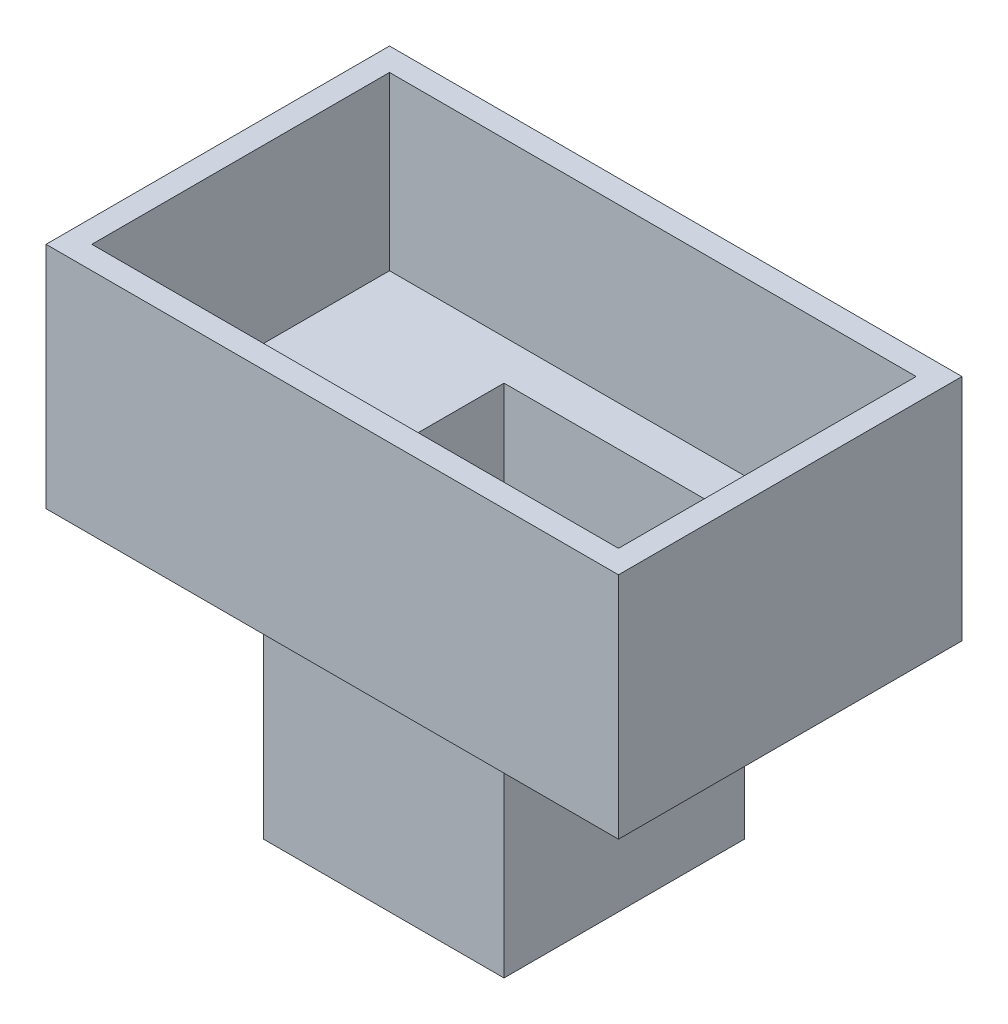
ISO-10303-21;
HEADER;
FILE_DESCRIPTION(('STEP AP214'),'2;1');
FILE_NAME('part.step','',(''),(''),'','','');
FILE_SCHEMA(('AUTOMOTIVE_DESIGN { 1 0 10303 214 1 1 1 1 }'));
ENDSEC;
DATA;
#1=APPLICATION_CONTEXT('core data for automotive mechanical design processes');
#2=APPLICATION_PROTOCOL_DEFINITION('international standard','automotive_design',2000,#1);
#3=PRODUCT_CONTEXT('',#1,'mechanical');
#4=PRODUCT('Part','Part','',(#3));
#5=PRODUCT_RELATED_PRODUCT_CATEGORY('part','',(#4));
#6=PRODUCT_DEFINITION_FORMATION('','',#4);
#7=PRODUCT_DEFINITION_CONTEXT('part definition',#1,'design');
#8=PRODUCT_DEFINITION('design','',#6,#7);
#9=PRODUCT_DEFINITION_SHAPE('','',#8);
#10=(LENGTH_UNIT() NAMED_UNIT(*) SI_UNIT(.MILLI.,.METRE.));
#11=(NAMED_UNIT(*) PLANE_ANGLE_UNIT() SI_UNIT($,.RADIAN.));
#12=(NAMED_UNIT(*) SI_UNIT($,.STERADIAN.) SOLID_ANGLE_UNIT());
#13=UNCERTAINTY_MEASURE_WITH_UNIT(LENGTH_MEASURE(1.E-05),#10,'distance_accuracy_value','');
#14=(GEOMETRIC_REPRESENTATION_CONTEXT(3) GLOBAL_UNCERTAINTY_ASSIGNED_CONTEXT((#13)) GLOBAL_UNIT_ASSIGNED_CONTEXT((#10,
#11,#12)) REPRESENTATION_CONTEXT('',''));
#15=CARTESIAN_POINT('',(0.,0.,0.));
#16=DIRECTION('',(0.,0.,1.));
#17=DIRECTION('',(1.,0.,0.));
#18=AXIS2_PLACEMENT_3D('',#15,#16,#17);
#19=CARTESIAN_POINT('',(-9.70588235294119,20.,-7.6764705882353));
#20=DIRECTION('',(1.,0.,0.));
#21=DIRECTION('',(0.,0.,-1.));
#22=AXIS2_PLACEMENT_3D('',#19,#20,#21);
#23=PLANE('',#22);
#24=DIRECTION('',(0.,0.,1.));
#25=VECTOR('',#24,1.);
#26=CARTESIAN_POINT('',(-9.70588235294119,0.,-7.6764705882353));
#27=LINE('',#26,#25);
#28=CARTESIAN_POINT('',(-9.70588235294119,0.,-7.6764705882353));
#29=VERTEX_POINT('',#28);
#30=CARTESIAN_POINT('',(-9.70588235294119,0.,13.3235294117647));
#31=VERTEX_POINT('',#30);
#32=EDGE_CURVE('E160',#29,#31,#27,.T.);
#33=ORIENTED_EDGE('',*,*,#32,.T.);
#34=DIRECTION('',(0.,-1.,0.));
#35=VECTOR('',#34,1.);
#36=CARTESIAN_POINT('',(-9.70588235294119,20.,13.3235294117647));
#37=LINE('',#36,#35);
#38=CARTESIAN_POINT('',(-9.70588235294119,20.,13.3235294117647));
#39=VERTEX_POINT('',#38);
#40=EDGE_CURVE('E168',#39,#31,#37,.T.);
#41=ORIENTED_EDGE('',*,*,#40,.F.);
#42=DIRECTION('',(0.,0.,1.));
#43=VECTOR('',#42,1.);
#44=CARTESIAN_POINT('',(-9.70588235294119,20.,-7.6764705882353));
#45=LINE('',#44,#43);
#46=CARTESIAN_POINT('',(-9.70588235294119,20.,-7.6764705882353));
#47=VERTEX_POINT('',#46);
#48=EDGE_CURVE('E191',#47,#39,#45,.T.);
#49=ORIENTED_EDGE('',*,*,#48,.F.);
#50=DIRECTION('',(0.,-1.,0.));
#51=VECTOR('',#50,1.);
#52=CARTESIAN_POINT('',(-9.70588235294119,20.,-7.6764705882353));
#53=LINE('',#52,#51);
#54=EDGE_CURVE('E185',#47,#29,#53,.T.);
#55=ORIENTED_EDGE('',*,*,#54,.T.);
#56=EDGE_LOOP('',(#33,#41,#49,#55));
#57=FACE_BOUND('',#56,.T.);
#58=ADVANCED_FACE('F41',(#57),#23,.F.);
#59=CARTESIAN_POINT('',(-9.70588235294119,20.,13.3235294117647));
#60=DIRECTION('',(0.,0.,-1.));
#61=DIRECTION('',(-1.,0.,0.));
#62=AXIS2_PLACEMENT_3D('',#59,#60,#61);
#63=PLANE('',#62);
#64=DIRECTION('',(1.,0.,0.));
#65=VECTOR('',#64,1.);
#66=CARTESIAN_POINT('',(-9.70588235294119,0.,13.3235294117647));
#67=LINE('',#66,#65);
#68=CARTESIAN_POINT('',(11.2941176470588,0.,13.3235294117647));
#69=VERTEX_POINT('',#68);
#70=EDGE_CURVE('E194',#31,#69,#67,.T.);
#71=ORIENTED_EDGE('',*,*,#70,.T.);
#72=DIRECTION('',(0.,-1.,0.));
#73=VECTOR('',#72,1.);
#74=CARTESIAN_POINT('',(11.2941176470588,20.,13.3235294117647));
#75=LINE('',#74,#73);
#76=CARTESIAN_POINT('',(11.2941176470588,20.,13.3235294117647));
#77=VERTEX_POINT('',#76);
#78=EDGE_CURVE('E179',#77,#69,#75,.T.);
#79=ORIENTED_EDGE('',*,*,#78,.F.);
#80=DIRECTION('',(1.,0.,0.));
#81=VECTOR('',#80,1.);
#82=CARTESIAN_POINT('',(-9.70588235294119,20.,13.3235294117647));
#83=LINE('',#82,#81);
#84=EDGE_CURVE('E203',#39,#77,#83,.T.);
#85=ORIENTED_EDGE('',*,*,#84,.F.);
#86=ORIENTED_EDGE('',*,*,#40,.T.);
#87=EDGE_LOOP('',(#71,#79,#85,#86));
#88=FACE_BOUND('',#87,.T.);
#89=ADVANCED_FACE('F337',(#88),#63,.F.);
#90=CARTESIAN_POINT('',(11.2941176470588,20.,-7.6764705882353));
#91=DIRECTION('',(-1.,0.,0.));
#92=DIRECTION('',(0.,0.,1.));
#93=AXIS2_PLACEMENT_3D('',#90,#91,#92);
#94=PLANE('',#93);
#95=DIRECTION('',(0.,0.,-1.));
#96=VECTOR('',#95,1.);
#97=CARTESIAN_POINT('',(11.2941176470588,0.,-7.6764705882353));
#98=LINE('',#97,#96);
#99=CARTESIAN_POINT('',(11.2941176470588,0.,-7.6764705882353));
#100=VERTEX_POINT('',#99);
#101=EDGE_CURVE('E192',#69,#100,#98,.T.);
#102=ORIENTED_EDGE('',*,*,#101,.T.);
#103=DIRECTION('',(0.,-1.,0.));
#104=VECTOR('',#103,1.);
#105=CARTESIAN_POINT('',(11.2941176470588,20.,-7.6764705882353));
#106=LINE('',#105,#104);
#107=CARTESIAN_POINT('',(11.2941176470588,20.,-7.6764705882353));
#108=VERTEX_POINT('',#107);
#109=EDGE_CURVE('E182',#108,#100,#106,.T.);
#110=ORIENTED_EDGE('',*,*,#109,.F.);
#111=DIRECTION('',(0.,0.,-1.));
#112=VECTOR('',#111,1.);
#113=CARTESIAN_POINT('',(11.2941176470588,20.,-7.6764705882353));
#114=LINE('',#113,#112);
#115=EDGE_CURVE('E200',#77,#108,#114,.T.);
#116=ORIENTED_EDGE('',*,*,#115,.F.);
#117=ORIENTED_EDGE('',*,*,#78,.T.);
#118=EDGE_LOOP('',(#102,#110,#116,#117));
#119=FACE_BOUND('',#118,.T.);
#120=ADVANCED_FACE('F339',(#119),#94,.F.);
#121=CARTESIAN_POINT('',(-9.70588235294119,20.,-7.6764705882353));
#122=DIRECTION('',(0.,0.,1.));
#123=DIRECTION('',(1.,0.,0.));
#124=AXIS2_PLACEMENT_3D('',#121,#122,#123);
#125=PLANE('',#124);
#126=DIRECTION('',(-1.,0.,0.));
#127=VECTOR('',#126,1.);
#128=CARTESIAN_POINT('',(-9.70588235294119,0.,-7.6764705882353));
#129=LINE('',#128,#127);
#130=EDGE_CURVE('E189',#100,#29,#129,.T.);
#131=ORIENTED_EDGE('',*,*,#130,.T.);
#132=ORIENTED_EDGE('',*,*,#54,.F.);
#133=DIRECTION('',(-1.,0.,0.));
#134=VECTOR('',#133,1.);
#135=CARTESIAN_POINT('',(-9.70588235294119,20.,-7.6764705882353));
#136=LINE('',#135,#134);
#137=EDGE_CURVE('E188',#108,#47,#136,.T.);
#138=ORIENTED_EDGE('',*,*,#137,.F.);
#139=ORIENTED_EDGE('',*,*,#109,.T.);
#140=EDGE_LOOP('',(#131,#132,#138,#139));
#141=FACE_BOUND('',#140,.T.);
#142=ADVANCED_FACE('F328',(#141),#125,.F.);
#143=CARTESIAN_POINT('',(0.,0.,0.));
#144=DIRECTION('',(0.,1.,0.));
#145=DIRECTION('',(0.,0.,1.));
#146=AXIS2_PLACEMENT_3D('',#143,#144,#145);
#147=PLANE('',#146);
#148=DIRECTION('',(-1.,0.,0.));
#149=VECTOR('',#148,1.);
#150=CARTESIAN_POINT('',(-8.70588235294119,0.,-6.6764705882353));
#151=LINE('',#150,#149);
#152=CARTESIAN_POINT('',(10.2941176470588,0.,-6.6764705882353));
#153=VERTEX_POINT('',#152);
#154=CARTESIAN_POINT('',(-8.70588235294119,0.,-6.6764705882353));
#155=VERTEX_POINT('',#154);
#156=EDGE_CURVE('E211',#153,#155,#151,.T.);
#157=ORIENTED_EDGE('',*,*,#156,.T.);
#158=DIRECTION('',(0.,0.,1.));
#159=VECTOR('',#158,1.);
#160=CARTESIAN_POINT('',(-8.70588235294119,0.,-6.6764705882353));
#161=LINE('',#160,#159);
#162=CARTESIAN_POINT('',(-8.70588235294119,0.,12.3235294117647));
#163=VERTEX_POINT('',#162);
#164=EDGE_CURVE('E158',#155,#163,#161,.T.);
#165=ORIENTED_EDGE('',*,*,#164,.T.);
#166=DIRECTION('',(1.,0.,0.));
#167=VECTOR('',#166,1.);
#168=CARTESIAN_POINT('',(-8.70588235294119,0.,12.3235294117647));
#169=LINE('',#168,#167);
#170=CARTESIAN_POINT('',(10.2941176470588,0.,12.3235294117647));
#171=VERTEX_POINT('',#170);
#172=EDGE_CURVE('E218',#163,#171,#169,.T.);
#173=ORIENTED_EDGE('',*,*,#172,.T.);
#174=DIRECTION('',(0.,0.,-1.));
#175=VECTOR('',#174,1.);
#176=CARTESIAN_POINT('',(10.2941176470588,0.,-6.6764705882353));
#177=LINE('',#176,#175);
#178=EDGE_CURVE('E215',#171,#153,#177,.T.);
#179=ORIENTED_EDGE('',*,*,#178,.T.);
#180=EDGE_LOOP('',(#157,#165,#173,#179));
#181=FACE_BOUND('',#180,.T.);
#182=ORIENTED_EDGE('',*,*,#32,.F.);
#183=ORIENTED_EDGE('',*,*,#130,.F.);
#184=ORIENTED_EDGE('',*,*,#101,.F.);
#185=ORIENTED_EDGE('',*,*,#70,.F.);
#186=EDGE_LOOP('',(#182,#183,#184,#185));
#187=FACE_BOUND('',#186,.T.);
#188=ADVANCED_FACE('F334',(#181,#187),#147,.F.);
#189=CARTESIAN_POINT('',(-8.70588235294119,0.,-6.6764705882353));
#190=DIRECTION('',(-1.,0.,0.));
#191=DIRECTION('',(0.,0.,1.));
#192=AXIS2_PLACEMENT_3D('',#189,#190,#191);
#193=PLANE('',#192);
#194=DIRECTION('',(0.,1.,0.));
#195=VECTOR('',#194,1.);
#196=CARTESIAN_POINT('',(-8.70588235294119,0.,-6.6764705882353));
#197=LINE('',#196,#195);
#198=CARTESIAN_POINT('',(-8.70588235294119,25.,-6.6764705882353));
#199=VERTEX_POINT('',#198);
#200=EDGE_CURVE('E153',#155,#199,#197,.T.);
#201=ORIENTED_EDGE('',*,*,#200,.T.);
#202=DIRECTION('',(0.,0.,1.));
#203=VECTOR('',#202,1.);
#204=CARTESIAN_POINT('',(-8.70588235294119,25.,0.));
#205=LINE('',#204,#203);
#206=CARTESIAN_POINT('',(-8.70588235294119,25.,12.3235294117647));
#207=VERTEX_POINT('',#206);
#208=EDGE_CURVE('E12',#199,#207,#205,.T.);
#209=ORIENTED_EDGE('',*,*,#208,.T.);
#210=DIRECTION('',(0.,1.,0.));
#211=VECTOR('',#210,1.);
#212=CARTESIAN_POINT('',(-8.70588235294119,0.,12.3235294117647));
#213=LINE('',#212,#211);
#214=EDGE_CURVE('E208',#163,#207,#213,.T.);
#215=ORIENTED_EDGE('',*,*,#214,.F.);
#216=ORIENTED_EDGE('',*,*,#164,.F.);
#217=EDGE_LOOP('',(#201,#209,#215,#216));
#218=FACE_BOUND('',#217,.T.);
#219=ADVANCED_FACE('F154',(#218),#193,.F.);
#220=CARTESIAN_POINT('',(-8.70588235294119,0.,-6.6764705882353));
#221=DIRECTION('',(0.,0.,-1.));
#222=DIRECTION('',(-1.,0.,0.));
#223=AXIS2_PLACEMENT_3D('',#220,#221,#222);
#224=PLANE('',#223);
#225=DIRECTION('',(0.,1.,0.));
#226=VECTOR('',#225,1.);
#227=CARTESIAN_POINT('',(10.2941176470588,0.,-6.6764705882353));
#228=LINE('',#227,#226);
#229=CARTESIAN_POINT('',(10.2941176470588,25.,-6.6764705882353));
#230=VERTEX_POINT('',#229);
#231=EDGE_CURVE('E55',#153,#230,#228,.T.);
#232=ORIENTED_EDGE('',*,*,#231,.T.);
#233=DIRECTION('',(-1.,0.,0.));
#234=VECTOR('',#233,1.);
#235=CARTESIAN_POINT('',(0.,25.,-6.6764705882353));
#236=LINE('',#235,#234);
#237=EDGE_CURVE('E163',#230,#199,#236,.T.);
#238=ORIENTED_EDGE('',*,*,#237,.T.);
#239=ORIENTED_EDGE('',*,*,#200,.F.);
#240=ORIENTED_EDGE('',*,*,#156,.F.);
#241=EDGE_LOOP('',(#232,#238,#239,#240));
#242=FACE_BOUND('',#241,.T.);
#243=ADVANCED_FACE('F164',(#242),#224,.F.);
#244=CARTESIAN_POINT('',(10.2941176470588,0.,-6.6764705882353));
#245=DIRECTION('',(1.,0.,0.));
#246=DIRECTION('',(0.,0.,-1.));
#247=AXIS2_PLACEMENT_3D('',#244,#245,#246);
#248=PLANE('',#247);
#249=DIRECTION('',(0.,1.,0.));
#250=VECTOR('',#249,1.);
#251=CARTESIAN_POINT('',(10.2941176470588,0.,12.3235294117647));
#252=LINE('',#251,#250);
#253=CARTESIAN_POINT('',(10.2941176470588,25.,12.3235294117647));
#254=VERTEX_POINT('',#253);
#255=EDGE_CURVE('E210',#171,#254,#252,.T.);
#256=ORIENTED_EDGE('',*,*,#255,.T.);
#257=DIRECTION('',(0.,0.,-1.));
#258=VECTOR('',#257,1.);
#259=CARTESIAN_POINT('',(10.2941176470588,25.,0.));
#260=LINE('',#259,#258);
#261=EDGE_CURVE('E167',#254,#230,#260,.T.);
#262=ORIENTED_EDGE('',*,*,#261,.T.);
#263=ORIENTED_EDGE('',*,*,#231,.F.);
#264=ORIENTED_EDGE('',*,*,#178,.F.);
#265=EDGE_LOOP('',(#256,#262,#263,#264));
#266=FACE_BOUND('',#265,.T.);
#267=ADVANCED_FACE('F478',(#266),#248,.F.);
#268=CARTESIAN_POINT('',(-8.70588235294119,0.,12.3235294117647));
#269=DIRECTION('',(0.,0.,1.));
#270=DIRECTION('',(1.,0.,0.));
#271=AXIS2_PLACEMENT_3D('',#268,#269,#270);
#272=PLANE('',#271);
#273=ORIENTED_EDGE('',*,*,#214,.T.);
#274=DIRECTION('',(1.,0.,0.));
#275=VECTOR('',#274,1.);
#276=CARTESIAN_POINT('',(0.,25.,12.3235294117647));
#277=LINE('',#276,#275);
#278=EDGE_CURVE('E48',#207,#254,#277,.T.);
#279=ORIENTED_EDGE('',*,*,#278,.T.);
#280=ORIENTED_EDGE('',*,*,#255,.F.);
#281=ORIENTED_EDGE('',*,*,#172,.F.);
#282=EDGE_LOOP('',(#273,#279,#280,#281));
#283=FACE_BOUND('',#282,.T.);
#284=ADVANCED_FACE('F300',(#283),#272,.F.);
#285=CARTESIAN_POINT('',(0.,40.,0.));
#286=DIRECTION('',(0.,1.,0.));
#287=DIRECTION('',(0.,0.,1.));
#288=AXIS2_PLACEMENT_3D('',#285,#286,#287);
#289=PLANE('',#288);
#290=DIRECTION('',(0.,0.,1.));
#291=VECTOR('',#290,1.);
#292=CARTESIAN_POINT('',(-22.2058823529412,40.,-10.1764705882353));
#293=LINE('',#292,#291);
#294=CARTESIAN_POINT('',(-22.2058823529412,40.,-10.1764705882353));
#295=VERTEX_POINT('',#294);
#296=CARTESIAN_POINT('',(-22.2058823529412,40.,15.8235294117647));
#297=VERTEX_POINT('',#296);
#298=EDGE_CURVE('E63',#295,#297,#293,.T.);
#299=ORIENTED_EDGE('',*,*,#298,.F.);
#300=DIRECTION('',(-1.,0.,0.));
#301=VECTOR('',#300,1.);
#302=CARTESIAN_POINT('',(-22.2058823529412,40.,-10.1764705882353));
#303=LINE('',#302,#301);
#304=CARTESIAN_POINT('',(23.7941176470588,40.,-10.1764705882353));
#305=VERTEX_POINT('',#304);
#306=EDGE_CURVE('E261',#305,#295,#303,.T.);
#307=ORIENTED_EDGE('',*,*,#306,.F.);
#308=DIRECTION('',(0.,0.,-1.));
#309=VECTOR('',#308,1.);
#310=CARTESIAN_POINT('',(23.7941176470588,40.,-10.1764705882353));
#311=LINE('',#310,#309);
#312=CARTESIAN_POINT('',(23.7941176470588,40.,15.8235294117647));
#313=VERTEX_POINT('',#312);
#314=EDGE_CURVE('E265',#313,#305,#311,.T.);
#315=ORIENTED_EDGE('',*,*,#314,.F.);
#316=DIRECTION('',(1.,0.,0.));
#317=VECTOR('',#316,1.);
#318=CARTESIAN_POINT('',(-22.2058823529412,40.,15.8235294117647));
#319=LINE('',#318,#317);
#320=EDGE_CURVE('E268',#297,#313,#319,.T.);
#321=ORIENTED_EDGE('',*,*,#320,.F.);
#322=EDGE_LOOP('',(#299,#307,#315,#321));
#323=FACE_BOUND('',#322,.T.);
#324=DIRECTION('',(0.,0.,1.));
#325=VECTOR('',#324,1.);
#326=CARTESIAN_POINT('',(-24.2058823529412,40.,-12.1764705882353));
#327=LINE('',#326,#325);
#328=CARTESIAN_POINT('',(-24.2058823529412,40.,-12.1764705882353));
#329=VERTEX_POINT('',#328);
#330=CARTESIAN_POINT('',(-24.2058823529412,40.,17.8235294117647));
#331=VERTEX_POINT('',#330);
#332=EDGE_CURVE('E237',#329,#331,#327,.T.);
#333=ORIENTED_EDGE('',*,*,#332,.T.);
#334=DIRECTION('',(1.,0.,0.));
#335=VECTOR('',#334,1.);
#336=CARTESIAN_POINT('',(-24.2058823529412,40.,17.8235294117647));
#337=LINE('',#336,#335);
#338=CARTESIAN_POINT('',(25.7941176470588,40.,17.8235294117647));
#339=VERTEX_POINT('',#338);
#340=EDGE_CURVE('E249',#331,#339,#337,.T.);
#341=ORIENTED_EDGE('',*,*,#340,.T.);
#342=DIRECTION('',(0.,0.,-1.));
#343=VECTOR('',#342,1.);
#344=CARTESIAN_POINT('',(25.7941176470588,40.,-12.1764705882353));
#345=LINE('',#344,#343);
#346=CARTESIAN_POINT('',(25.7941176470588,40.,-12.1764705882353));
#347=VERTEX_POINT('',#346);
#348=EDGE_CURVE('E247',#339,#347,#345,.T.);
#349=ORIENTED_EDGE('',*,*,#348,.T.);
#350=DIRECTION('',(-1.,0.,0.));
#351=VECTOR('',#350,1.);
#352=CARTESIAN_POINT('',(-24.2058823529412,40.,-12.1764705882353));
#353=LINE('',#352,#351);
#354=EDGE_CURVE('E234',#347,#329,#353,.T.);
#355=ORIENTED_EDGE('',*,*,#354,.T.);
#356=EDGE_LOOP('',(#333,#341,#349,#355));
#357=FACE_BOUND('',#356,.T.);
#358=ADVANCED_FACE('F296',(#323,#357),#289,.T.);
#359=CARTESIAN_POINT('',(-24.2058823529412,40.,-12.1764705882353));
#360=DIRECTION('',(0.,0.,1.));
#361=DIRECTION('',(1.,0.,0.));
#362=AXIS2_PLACEMENT_3D('',#359,#360,#361);
#363=PLANE('',#362);
#364=DIRECTION('',(-1.,0.,0.));
#365=VECTOR('',#364,1.);
#366=CARTESIAN_POINT('',(-24.2058823529412,20.,-12.1764705882353));
#367=LINE('',#366,#365);
#368=CARTESIAN_POINT('',(25.7941176470588,20.,-12.1764705882353));
#369=VERTEX_POINT('',#368);
#370=CARTESIAN_POINT('',(-24.2058823529412,20.,-12.1764705882353));
#371=VERTEX_POINT('',#370);
#372=EDGE_CURVE('E235',#369,#371,#367,.T.);
#373=ORIENTED_EDGE('',*,*,#372,.T.);
#374=DIRECTION('',(0.,-1.,0.));
#375=VECTOR('',#374,1.);
#376=CARTESIAN_POINT('',(-24.2058823529412,40.,-12.1764705882353));
#377=LINE('',#376,#375);
#378=EDGE_CURVE('E231',#329,#371,#377,.T.);
#379=ORIENTED_EDGE('',*,*,#378,.F.);
#380=ORIENTED_EDGE('',*,*,#354,.F.);
#381=DIRECTION('',(0.,-1.,0.));
#382=VECTOR('',#381,1.);
#383=CARTESIAN_POINT('',(25.7941176470588,40.,-12.1764705882353));
#384=LINE('',#383,#382);
#385=EDGE_CURVE('E228',#347,#369,#384,.T.);
#386=ORIENTED_EDGE('',*,*,#385,.T.);
#387=EDGE_LOOP('',(#373,#379,#380,#386));
#388=FACE_BOUND('',#387,.T.);
#389=ADVANCED_FACE('F299',(#388),#363,.F.);
#390=CARTESIAN_POINT('',(25.7941176470588,40.,-12.1764705882353));
#391=DIRECTION('',(-1.,0.,0.));
#392=DIRECTION('',(0.,0.,1.));
#393=AXIS2_PLACEMENT_3D('',#390,#391,#392);
#394=PLANE('',#393);
#395=DIRECTION('',(0.,0.,-1.));
#396=VECTOR('',#395,1.);
#397=CARTESIAN_POINT('',(25.7941176470588,20.,-12.1764705882353));
#398=LINE('',#397,#396);
#399=CARTESIAN_POINT('',(25.7941176470588,20.,17.8235294117647));
#400=VERTEX_POINT('',#399);
#401=EDGE_CURVE('E238',#400,#369,#398,.T.);
#402=ORIENTED_EDGE('',*,*,#401,.T.);
#403=ORIENTED_EDGE('',*,*,#385,.F.);
#404=ORIENTED_EDGE('',*,*,#348,.F.);
#405=DIRECTION('',(0.,-1.,0.));
#406=VECTOR('',#405,1.);
#407=CARTESIAN_POINT('',(25.7941176470588,40.,17.8235294117647));
#408=LINE('',#407,#406);
#409=EDGE_CURVE('E225',#339,#400,#408,.T.);
#410=ORIENTED_EDGE('',*,*,#409,.T.);
#411=EDGE_LOOP('',(#402,#403,#404,#410));
#412=FACE_BOUND('',#411,.T.);
#413=ADVANCED_FACE('F316',(#412),#394,.F.);
#414=CARTESIAN_POINT('',(-24.2058823529412,40.,17.8235294117647));
#415=DIRECTION('',(0.,0.,-1.));
#416=DIRECTION('',(-1.,0.,0.));
#417=AXIS2_PLACEMENT_3D('',#414,#415,#416);
#418=PLANE('',#417);
#419=DIRECTION('',(1.,0.,0.));
#420=VECTOR('',#419,1.);
#421=CARTESIAN_POINT('',(-24.2058823529412,20.,17.8235294117647));
#422=LINE('',#421,#420);
#423=CARTESIAN_POINT('',(-24.2058823529412,20.,17.8235294117647));
#424=VERTEX_POINT('',#423);
#425=EDGE_CURVE('E240',#424,#400,#422,.T.);
#426=ORIENTED_EDGE('',*,*,#425,.T.);
#427=ORIENTED_EDGE('',*,*,#409,.F.);
#428=ORIENTED_EDGE('',*,*,#340,.F.);
#429=DIRECTION('',(0.,-1.,0.));
#430=VECTOR('',#429,1.);
#431=CARTESIAN_POINT('',(-24.2058823529412,40.,17.8235294117647));
#432=LINE('',#431,#430);
#433=EDGE_CURVE('E222',#331,#424,#432,.T.);
#434=ORIENTED_EDGE('',*,*,#433,.T.);
#435=EDGE_LOOP('',(#426,#427,#428,#434));
#436=FACE_BOUND('',#435,.T.);
#437=ADVANCED_FACE('F311',(#436),#418,.F.);
#438=CARTESIAN_POINT('',(-24.2058823529412,40.,-12.1764705882353));
#439=DIRECTION('',(1.,0.,0.));
#440=DIRECTION('',(0.,0.,-1.));
#441=AXIS2_PLACEMENT_3D('',#438,#439,#440);
#442=PLANE('',#441);
#443=DIRECTION('',(0.,0.,1.));
#444=VECTOR('',#443,1.);
#445=CARTESIAN_POINT('',(-24.2058823529412,20.,-12.1764705882353));
#446=LINE('',#445,#444);
#447=EDGE_CURVE('E242',#371,#424,#446,.T.);
#448=ORIENTED_EDGE('',*,*,#447,.T.);
#449=ORIENTED_EDGE('',*,*,#433,.F.);
#450=ORIENTED_EDGE('',*,*,#332,.F.);
#451=ORIENTED_EDGE('',*,*,#378,.T.);
#452=EDGE_LOOP('',(#448,#449,#450,#451));
#453=FACE_BOUND('',#452,.T.);
#454=ADVANCED_FACE('F308',(#453),#442,.F.);
#455=CARTESIAN_POINT('',(0.,20.,0.));
#456=DIRECTION('',(0.,1.,0.));
#457=DIRECTION('',(0.,0.,1.));
#458=AXIS2_PLACEMENT_3D('',#455,#456,#457);
#459=PLANE('',#458);
#460=ORIENTED_EDGE('',*,*,#447,.F.);
#461=ORIENTED_EDGE('',*,*,#372,.F.);
#462=ORIENTED_EDGE('',*,*,#401,.F.);
#463=ORIENTED_EDGE('',*,*,#425,.F.);
#464=EDGE_LOOP('',(#460,#461,#462,#463));
#465=FACE_BOUND('',#464,.T.);
#466=ORIENTED_EDGE('',*,*,#137,.T.);
#467=ORIENTED_EDGE('',*,*,#48,.T.);
#468=ORIENTED_EDGE('',*,*,#84,.T.);
#469=ORIENTED_EDGE('',*,*,#115,.T.);
#470=EDGE_LOOP('',(#466,#467,#468,#469));
#471=FACE_BOUND('',#470,.T.);
#472=ADVANCED_FACE('F320',(#465,#471),#459,.F.);
#473=CARTESIAN_POINT('',(-22.2058823529412,25.,-10.1764705882353));
#474=DIRECTION('',(-1.,0.,0.));
#475=DIRECTION('',(0.,0.,1.));
#476=AXIS2_PLACEMENT_3D('',#473,#474,#475);
#477=PLANE('',#476);
#478=ORIENTED_EDGE('',*,*,#298,.T.);
#479=DIRECTION('',(0.,1.,0.));
#480=VECTOR('',#479,1.);
#481=CARTESIAN_POINT('',(-22.2058823529412,25.,15.8235294117647));
#482=LINE('',#481,#480);
#483=CARTESIAN_POINT('',(-22.2058823529412,25.,15.8235294117647));
#484=VERTEX_POINT('',#483);
#485=EDGE_CURVE('E253',#484,#297,#482,.T.);
#486=ORIENTED_EDGE('',*,*,#485,.F.);
#487=DIRECTION('',(0.,0.,1.));
#488=VECTOR('',#487,1.);
#489=CARTESIAN_POINT('',(-22.2058823529412,25.,-10.1764705882353));
#490=LINE('',#489,#488);
#491=CARTESIAN_POINT('',(-22.2058823529412,25.,-10.1764705882353));
#492=VERTEX_POINT('',#491);
#493=EDGE_CURVE('E264',#492,#484,#490,.T.);
#494=ORIENTED_EDGE('',*,*,#493,.F.);
#495=DIRECTION('',(0.,1.,0.));
#496=VECTOR('',#495,1.);
#497=CARTESIAN_POINT('',(-22.2058823529412,25.,-10.1764705882353));
#498=LINE('',#497,#496);
#499=EDGE_CURVE('E245',#492,#295,#498,.T.);
#500=ORIENTED_EDGE('',*,*,#499,.T.);
#501=EDGE_LOOP('',(#478,#486,#494,#500));
#502=FACE_BOUND('',#501,.T.);
#503=ADVANCED_FACE('F284',(#502),#477,.F.);
#504=CARTESIAN_POINT('',(-22.2058823529412,25.,-10.1764705882353));
#505=DIRECTION('',(0.,0.,-1.));
#506=DIRECTION('',(-1.,0.,0.));
#507=AXIS2_PLACEMENT_3D('',#504,#505,#506);
#508=PLANE('',#507);
#509=ORIENTED_EDGE('',*,*,#306,.T.);
#510=ORIENTED_EDGE('',*,*,#499,.F.);
#511=DIRECTION('',(-1.,0.,0.));
#512=VECTOR('',#511,1.);
#513=CARTESIAN_POINT('',(-22.2058823529412,25.,-10.1764705882353));
#514=LINE('',#513,#512);
#515=CARTESIAN_POINT('',(23.7941176470588,25.,-10.1764705882353));
#516=VERTEX_POINT('',#515);
#517=EDGE_CURVE('E256',#516,#492,#514,.T.);
#518=ORIENTED_EDGE('',*,*,#517,.F.);
#519=DIRECTION('',(0.,1.,0.));
#520=VECTOR('',#519,1.);
#521=CARTESIAN_POINT('',(23.7941176470588,25.,-10.1764705882353));
#522=LINE('',#521,#520);
#523=EDGE_CURVE('E258',#516,#305,#522,.T.);
#524=ORIENTED_EDGE('',*,*,#523,.T.);
#525=EDGE_LOOP('',(#509,#510,#518,#524));
#526=FACE_BOUND('',#525,.T.);
#527=ADVANCED_FACE('F293',(#526),#508,.F.);
#528=CARTESIAN_POINT('',(23.7941176470588,25.,-10.1764705882353));
#529=DIRECTION('',(1.,0.,0.));
#530=DIRECTION('',(0.,0.,-1.));
#531=AXIS2_PLACEMENT_3D('',#528,#529,#530);
#532=PLANE('',#531);
#533=ORIENTED_EDGE('',*,*,#314,.T.);
#534=ORIENTED_EDGE('',*,*,#523,.F.);
#535=DIRECTION('',(0.,0.,-1.));
#536=VECTOR('',#535,1.);
#537=CARTESIAN_POINT('',(23.7941176470588,25.,-10.1764705882353));
#538=LINE('',#537,#536);
#539=CARTESIAN_POINT('',(23.7941176470588,25.,15.8235294117647));
#540=VERTEX_POINT('',#539);
#541=EDGE_CURVE('E274',#540,#516,#538,.T.);
#542=ORIENTED_EDGE('',*,*,#541,.F.);
#543=DIRECTION('',(0.,1.,0.));
#544=VECTOR('',#543,1.);
#545=CARTESIAN_POINT('',(23.7941176470588,25.,15.8235294117647));
#546=LINE('',#545,#544);
#547=EDGE_CURVE('E255',#540,#313,#546,.T.);
#548=ORIENTED_EDGE('',*,*,#547,.T.);
#549=EDGE_LOOP('',(#533,#534,#542,#548));
#550=FACE_BOUND('',#549,.T.);
#551=ADVANCED_FACE('F291',(#550),#532,.F.);
#552=CARTESIAN_POINT('',(-22.2058823529412,25.,15.8235294117647));
#553=DIRECTION('',(0.,0.,1.));
#554=DIRECTION('',(1.,0.,0.));
#555=AXIS2_PLACEMENT_3D('',#552,#553,#554);
#556=PLANE('',#555);
#557=ORIENTED_EDGE('',*,*,#320,.T.);
#558=ORIENTED_EDGE('',*,*,#547,.F.);
#559=DIRECTION('',(1.,0.,0.));
#560=VECTOR('',#559,1.);
#561=CARTESIAN_POINT('',(-22.2058823529412,25.,15.8235294117647));
#562=LINE('',#561,#560);
#563=EDGE_CURVE('E277',#484,#540,#562,.T.);
#564=ORIENTED_EDGE('',*,*,#563,.F.);
#565=ORIENTED_EDGE('',*,*,#485,.T.);
#566=EDGE_LOOP('',(#557,#558,#564,#565));
#567=FACE_BOUND('',#566,.T.);
#568=ADVANCED_FACE('F287',(#567),#556,.F.);
#569=CARTESIAN_POINT('',(0.,25.,0.));
#570=DIRECTION('',(0.,1.,0.));
#571=DIRECTION('',(0.,0.,1.));
#572=AXIS2_PLACEMENT_3D('',#569,#570,#571);
#573=PLANE('',#572);
#574=ORIENTED_EDGE('',*,*,#208,.F.);
#575=ORIENTED_EDGE('',*,*,#237,.F.);
#576=ORIENTED_EDGE('',*,*,#261,.F.);
#577=ORIENTED_EDGE('',*,*,#278,.F.);
#578=EDGE_LOOP('',(#574,#575,#576,#577));
#579=FACE_BOUND('',#578,.T.);
#580=ORIENTED_EDGE('',*,*,#493,.T.);
#581=ORIENTED_EDGE('',*,*,#563,.T.);
#582=ORIENTED_EDGE('',*,*,#541,.T.);
#583=ORIENTED_EDGE('',*,*,#517,.T.);
#584=EDGE_LOOP('',(#580,#581,#582,#583));
#585=FACE_BOUND('',#584,.T.);
#586=ADVANCED_FACE('F170',(#579,#585),#573,.T.);
#587=CLOSED_SHELL('',(#58,#89,#120,#142,#188,#219,#243,#267,#284,#358,#389,#413,#437,#454,#472,
#503,#527,#551,#568,#586));
#588=MANIFOLD_SOLID_BREP('B2',#587);
#589=ADVANCED_BREP_SHAPE_REPRESENTATION('',(#18,#588),#14);
#590=SHAPE_DEFINITION_REPRESENTATION(#9,#589);
ENDSEC;
END-ISO-10303-21;
